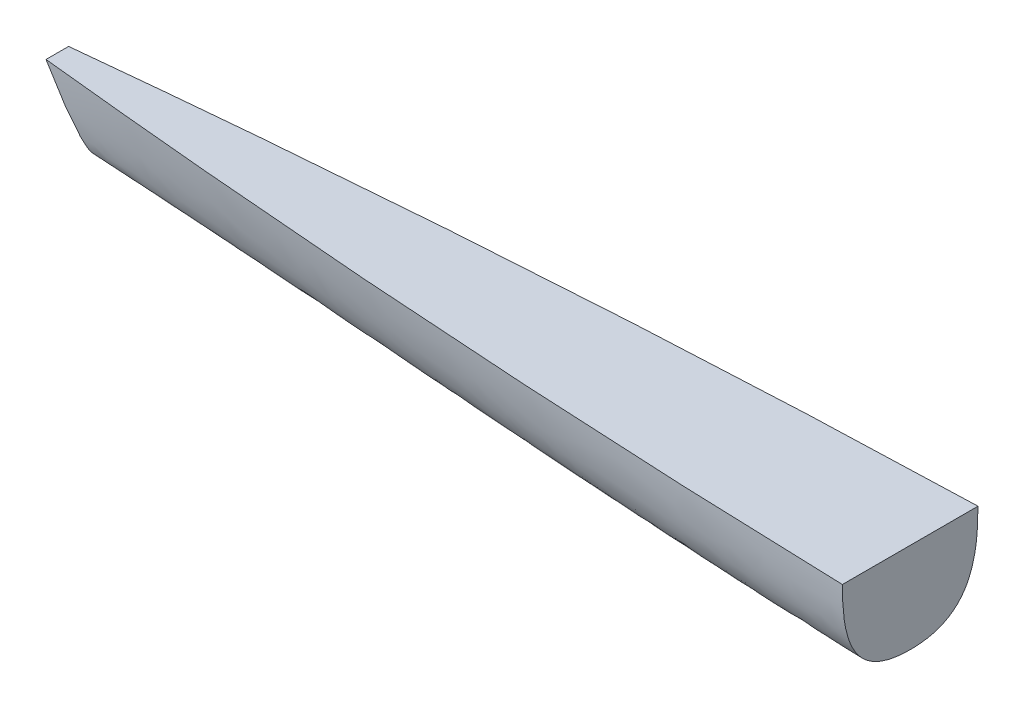
ISO-10303-21;
HEADER;
FILE_DESCRIPTION(('STEP AP214'),'2;1');
FILE_NAME('part.step','',(''),(''),'','','');
FILE_SCHEMA(('AUTOMOTIVE_DESIGN { 1 0 10303 214 1 1 1 1 }'));
ENDSEC;
DATA;
#1=APPLICATION_CONTEXT('core data for automotive mechanical design processes');
#2=APPLICATION_PROTOCOL_DEFINITION('international standard','automotive_design',2000,#1);
#3=PRODUCT_CONTEXT('',#1,'mechanical');
#4=PRODUCT('Part','Part','',(#3));
#5=PRODUCT_RELATED_PRODUCT_CATEGORY('part','',(#4));
#6=PRODUCT_DEFINITION_FORMATION('','',#4);
#7=PRODUCT_DEFINITION_CONTEXT('part definition',#1,'design');
#8=PRODUCT_DEFINITION('design','',#6,#7);
#9=PRODUCT_DEFINITION_SHAPE('','',#8);
#10=(LENGTH_UNIT() NAMED_UNIT(*) SI_UNIT(.MILLI.,.METRE.));
#11=(NAMED_UNIT(*) PLANE_ANGLE_UNIT() SI_UNIT($,.RADIAN.));
#12=(NAMED_UNIT(*) SI_UNIT($,.STERADIAN.) SOLID_ANGLE_UNIT());
#13=UNCERTAINTY_MEASURE_WITH_UNIT(LENGTH_MEASURE(1.E-05),#10,'distance_accuracy_value','');
#14=(GEOMETRIC_REPRESENTATION_CONTEXT(3) GLOBAL_UNCERTAINTY_ASSIGNED_CONTEXT((#13)) GLOBAL_UNIT_ASSIGNED_CONTEXT((#10,
#11,#12)) REPRESENTATION_CONTEXT('',''));
#15=CARTESIAN_POINT('',(0.,0.,0.));
#16=DIRECTION('',(0.,0.,1.));
#17=DIRECTION('',(1.,0.,0.));
#18=AXIS2_PLACEMENT_3D('',#15,#16,#17);
#19=CARTESIAN_POINT('',(435.202954743875,38.1,-31.75));
#20=CARTESIAN_POINT('',(289.96470358542,38.1,-40.0082514445591));
#21=CARTESIAN_POINT('',(-3.47870363388707,38.1,-44.1608103430224));
#22=CARTESIAN_POINT('',(-319.63529641458,38.1,-23.0749181112258));
#23=CARTESIAN_POINT('',(-479.197045256125,38.1,-6.35));
#24=CARTESIAN_POINT('',(456.369621410542,1.43825790645888,-31.75));
#25=CARTESIAN_POINT('',(308.744120638238,-1.38396431576335,-37.2555009630394));
#26=CARTESIAN_POINT('',(-18.3058318151969,19.9050399712793,-48.2472921755886));
#27=CARTESIAN_POINT('',(-309.322546028428,13.2807325216531,-17.4999454074839));
#28=CARTESIAN_POINT('',(-466.497045256125,16.1029547438753,-6.35));
#29=CARTESIAN_POINT('',(457.2,0.,-33.8666666666667));
#30=CARTESIAN_POINT('',(307.187249613848,-5.64444444444444,-36.6194171481864));
#31=CARTESIAN_POINT('',(-20.7324014512263,-19.7683175000991,-43.732083273171));
#32=CARTESIAN_POINT('',(-302.412750386152,-5.64444444444449,-9.80830603707527));
#33=CARTESIAN_POINT('',(-457.2,0.,-4.23333333333334));
#34=CARTESIAN_POINT('',(457.2,0.,0.));
#35=CARTESIAN_POINT('',(304.8,-8.46666666666666,0.));
#36=CARTESIAN_POINT('',(-18.3408338291158,-16.9409905000595,0.));
#37=CARTESIAN_POINT('',(-304.8,-8.46666666666668,0.));
#38=CARTESIAN_POINT('',(-457.2,0.,0.));
#39=B_SPLINE_SURFACE_WITH_KNOTS('',3,3,((#19,#20,#21,#22,#23),(#24,#25,#26,#27,#28),(#29,#30,
#31,#32,#33),(#34,#35,#36,#37,#38)),.UNSPECIFIED.,.F.,.F.,.F.,(4,4),(4,1,4),(0.,1.),(0.,
0.48497025791141,1.),.UNSPECIFIED.);
#40=CARTESIAN_POINT('',(435.202954743875,38.1,-31.75));
#41=CARTESIAN_POINT('',(289.96470358542,38.1,-40.0082514445591));
#42=CARTESIAN_POINT('',(-3.47870363388707,38.1,-44.1608103430224));
#43=CARTESIAN_POINT('',(-319.63529641458,38.1,-23.0749181112258));
#44=CARTESIAN_POINT('',(-479.197045256125,38.1,-6.35));
#45=B_SPLINE_CURVE_WITH_KNOTS('',3,(#40,#41,#42,#43,#44),.UNSPECIFIED.,.F.,.F.,(4,1,4),(0.,
0.48497025791141,1.),.UNSPECIFIED.);
#46=CARTESIAN_POINT('',(-479.197045256125,38.1,-6.35));
#47=VERTEX_POINT('',#46);
#48=CARTESIAN_POINT('',(0.,38.1,-38.1000000000008));
#49=VERTEX_POINT('',#48);
#50=EDGE_CURVE('E63',#47,#49,#45,.F.);
#51=CARTESIAN_POINT('',(1.59387635362577E-11,38.1,-38.1000000000008));
#52=CARTESIAN_POINT('',(5.72955891462524E-12,37.226321353687,-38.0999765086818));
#53=CARTESIAN_POINT('',(1.5367626246751E-12,36.3526100181256,-38.0949890198472));
#54=CARTESIAN_POINT('',(-1.53993615513407E-12,34.6035421586821,-38.0728431932275));
#55=CARTESIAN_POINT('',(-4.12857499480037E-13,33.7281859633354,-38.0556597429927));
#56=CARTESIAN_POINT('',(4.13336605165295E-13,31.9768432606056,-38.0068325038254));
#57=CARTESIAN_POINT('',(1.10793438461177E-13,31.1008572005879,-37.9751719573512));
#58=CARTESIAN_POINT('',(-1.10837327915929E-13,29.3492984705658,-37.894914525105));
#59=CARTESIAN_POINT('',(0.,28.473726101785,-37.8463109351793));
#60=CARTESIAN_POINT('',(0.,26.7045279866599,-37.7282077654566));
#61=CARTESIAN_POINT('',(0.,25.8109309698261,-37.6582700584362));
#62=CARTESIAN_POINT('',(0.,24.0263129374463,-37.4948064087426));
#63=CARTESIAN_POINT('',(0.,23.1352908650599,-37.4012921688014));
#64=CARTESIAN_POINT('',(0.,21.3569541348658,-37.1872264835341));
#65=CARTESIAN_POINT('',(0.,20.4696377316576,-37.0666896973985));
#66=CARTESIAN_POINT('',(0.,18.699871739935,-36.7946982795413));
#67=CARTESIAN_POINT('',(0.,17.8174212273931,-36.6432497412618));
#68=CARTESIAN_POINT('',(0.,16.2135485892853,-36.3347920541466));
#69=CARTESIAN_POINT('',(0.,15.4910447234123,-36.1834230682957));
#70=CARTESIAN_POINT('',(0.,14.0520148373611,-35.8540806895593));
#71=CARTESIAN_POINT('',(0.,13.3354893589012,-35.6761049128155));
#72=CARTESIAN_POINT('',(0.,11.9102124223037,-35.2907171573693));
#73=CARTESIAN_POINT('',(0.,11.2014624065328,-35.0832998134259));
#74=CARTESIAN_POINT('',(0.,9.79789409932042,-34.6372853586437));
#75=CARTESIAN_POINT('',(0.,9.1030220693067,-34.3988583382979));
#76=CARTESIAN_POINT('',(0.,7.72629025931103,-33.8870750179801));
#77=CARTESIAN_POINT('',(0.,7.04442902300543,-33.6137226539438));
#78=CARTESIAN_POINT('',(0.,5.69718240582928,-33.0292718708644));
#79=CARTESIAN_POINT('',(0.,5.03179264719587,-32.7181836137591));
#80=CARTESIAN_POINT('',(0.,3.88041053463327,-32.1360908535973));
#81=CARTESIAN_POINT('',(0.,3.39006714392858,-31.8736783345804));
#82=CARTESIAN_POINT('',(0.,2.42301021323202,-31.3248268390383));
#83=CARTESIAN_POINT('',(0.,1.94629583246889,-31.0383893489165));
#84=CARTESIAN_POINT('',(0.,1.00858406705439,-30.4408293787405));
#85=CARTESIAN_POINT('',(0.,0.547586310796632,-30.129707482908));
#86=CARTESIAN_POINT('',(0.,-0.356192177897837,-29.4826803890986));
#87=CARTESIAN_POINT('',(0.,-0.798986157879691,-29.1467937290513));
#88=CARTESIAN_POINT('',(0.,-1.66456361199939,-28.4500741226218));
#89=CARTESIAN_POINT('',(0.,-2.08734592399821,-28.0892397304352));
#90=CARTESIAN_POINT('',(0.,-2.9107739864043,-27.3431509568606));
#91=CARTESIAN_POINT('',(0.,-3.31142065989168,-26.9578975952109));
#92=CARTESIAN_POINT('',(0.,-4.09051864866947,-26.1620624969284));
#93=CARTESIAN_POINT('',(0.,-4.46885907468904,-25.7513721384393));
#94=CARTESIAN_POINT('',(0.,-5.19977462539714,-24.9076273984455));
#95=CARTESIAN_POINT('',(0.,-5.55234820877971,-24.474571681743));
#96=CARTESIAN_POINT('',(0.,-6.2305115502425,-23.5878859603573));
#97=CARTESIAN_POINT('',(0.,-6.55610337919146,-23.1342575387864));
#98=CARTESIAN_POINT('',(0.,-7.17989437807923,-22.2079913729483));
#99=CARTESIAN_POINT('',(0.,-7.4780696432119,-21.7353375468465));
#100=CARTESIAN_POINT('',(0.,-8.04648997478124,-20.7735044475421));
#101=CARTESIAN_POINT('',(0.,-8.31673330529007,-20.284324149748));
#102=CARTESIAN_POINT('',(0.,-8.82947963688997,-19.2916455426579));
#103=CARTESIAN_POINT('',(0.,-9.07198121899132,-18.7881465026019));
#104=CARTESIAN_POINT('',(0.,-9.58654081921422,-17.6426828277292));
#105=CARTESIAN_POINT('',(0.,-9.85103867159712,-16.9973157066708));
#106=CARTESIAN_POINT('',(0.,-10.3395582076258,-15.6913348651136));
#107=CARTESIAN_POINT('',(0.,-10.5635687203218,-15.0307169932738));
#108=CARTESIAN_POINT('',(0.,-10.9733586220885,-13.6976970176145));
#109=CARTESIAN_POINT('',(0.,-11.1591333226172,-13.0252934795729));
#110=CARTESIAN_POINT('',(0.,-11.4954168892135,-11.6699143813416));
#111=CARTESIAN_POINT('',(0.,-11.6458320563939,-10.9869157328167));
#112=CARTESIAN_POINT('',(0.,-11.9134271807541,-9.61461108417581));
#113=CARTESIAN_POINT('',(0.,-12.030613185359,-8.92530625533265));
#114=CARTESIAN_POINT('',(0.,-12.2344077443895,-7.5423721377786));
#115=CARTESIAN_POINT('',(0.,-12.3210213587308,-6.84874358402732));
#116=CARTESIAN_POINT('',(0.,-12.5007336459057,-5.12838979772055));
#117=CARTESIAN_POINT('',(0.,-12.5773766723995,-4.09991715907661));
#118=CARTESIAN_POINT('',(0.,-12.6520436120708,-2.55900726478948));
#119=CARTESIAN_POINT('',(0.,-12.6702221114284,-2.04740806056589));
#120=CARTESIAN_POINT('',(0.,-12.6941963429377,-1.0238789152056));
#121=CARTESIAN_POINT('',(0.,-12.6999911707813,-0.511948952645864));
#122=CARTESIAN_POINT('',(0.,-12.7,0.));
#123=B_SPLINE_CURVE_WITH_KNOTS('',3,(#51,#52,#53,#54,#55,#56,#57,#58,#59,#60,#61,#62,#63,#64,
#65,#66,#67,#68,#69,#70,#71,#72,#73,#74,#75,#76,#77,#78,#79,#80,#81,#82,#83,#84,#85,#86,#87,#88,
#89,#90,#91,#92,#93,#94,#95,#96,#97,#98,#99,#100,#101,#102,#103,#104,#105,#106,#107,#108,#109,
#110,#111,#112,#113,#114,#115,#116,#117,#118,#119,#120,#121,#122),.UNSPECIFIED.,.F.,.F.,(4,2,2,
2,2,2,2,2,2,2,2,2,2,2,2,2,2,2,2,2,2,2,2,2,2,2,2,2,2,2,2,2,2,2,2,4),(0.,2.62107113267705,
5.24755497447465,7.87708675252731,10.5076601871762,13.1963783207727,15.8837644684278,
18.5696962755038,21.2550991319554,23.4692310291679,25.683561422459,27.8982958603115,
30.1013578152933,32.3041717133129,34.5063937247179,36.1742121200127,37.8419274048954,
39.5096032306664,41.1760431321608,42.8425796905026,44.5090466999283,46.1831996036356,
47.8574525690177,49.5315769150595,51.2071473749107,52.8828219064176,54.558582110347,
56.6494751055499,58.7409441258098,60.832669453062,62.9298766688586,65.0267019654483,
67.1231800618485,70.2153152027145,71.7509682942136,73.2867335217859),.UNSPECIFIED.);
#124=CARTESIAN_POINT('',(-3.58319376848813E-10,-12.7000000000006,0.));
#125=VERTEX_POINT('',#124);
#126=EDGE_CURVE('E90',#49,#125,#123,.T.);
#127=CARTESIAN_POINT('',(457.2,0.,0.));
#128=CARTESIAN_POINT('',(304.8,-8.46666666666666,0.));
#129=CARTESIAN_POINT('',(-18.3408338291158,-16.9409905000595,0.));
#130=CARTESIAN_POINT('',(-304.8,-8.46666666666668,0.));
#131=CARTESIAN_POINT('',(-457.2,0.,0.));
#132=B_SPLINE_CURVE_WITH_KNOTS('',3,(#127,#128,#129,#130,#131),.UNSPECIFIED.,.F.,.F.,(4,1,4),
(0.,0.48497025791141,1.),.UNSPECIFIED.);
#133=CARTESIAN_POINT('',(-457.2,0.,0.));
#134=VERTEX_POINT('',#133);
#135=EDGE_CURVE('E95',#134,#125,#132,.F.);
#136=CARTESIAN_POINT('',(-479.197045256125,38.1,-6.35));
#137=CARTESIAN_POINT('',(-466.497045256125,16.1029547438753,-6.35));
#138=CARTESIAN_POINT('',(-457.2,0.,-4.23333333333334));
#139=CARTESIAN_POINT('',(-457.2,0.,0.));
#140=B_SPLINE_CURVE_WITH_KNOTS('',3,(#136,#137,#138,#139),.UNSPECIFIED.,.F.,.F.,(4,4),(0.,1.),.UNSPECIFIED.);
#141=EDGE_CURVE('E77',#47,#134,#140,.T.);
#142=ORIENTED_EDGE('',*,*,#50,.T.);
#143=ORIENTED_EDGE('',*,*,#126,.T.);
#144=ORIENTED_EDGE('',*,*,#135,.F.);
#145=ORIENTED_EDGE('',*,*,#141,.F.);
#146=EDGE_LOOP('',(#142,#143,#144,#145));
#147=FACE_BOUND('',#146,.T.);
#148=ADVANCED_FACE('F48',(#147),#39,.T.);
#149=CARTESIAN_POINT('',(0.,38.1,0.));
#150=DIRECTION('',(0.,-1.,0.));
#151=DIRECTION('',(0.,0.,-1.));
#152=AXIS2_PLACEMENT_3D('',#149,#150,#151);
#153=PLANE('',#152);
#154=DIRECTION('',(0.,0.,1.));
#155=VECTOR('',#154,1.);
#156=CARTESIAN_POINT('',(0.,38.1,0.));
#157=LINE('',#156,#155);
#158=CARTESIAN_POINT('',(1.58956186423035E-11,38.1,38.1000000000004));
#159=VERTEX_POINT('',#158);
#160=EDGE_CURVE('E70',#49,#159,#157,.T.);
#161=ORIENTED_EDGE('',*,*,#160,.F.);
#162=ORIENTED_EDGE('',*,*,#50,.F.);
#163=DIRECTION('',(0.,0.,-1.));
#164=VECTOR('',#163,1.);
#165=CARTESIAN_POINT('',(-479.197045256125,38.1,0.));
#166=LINE('',#165,#164);
#167=CARTESIAN_POINT('',(-479.197045256125,38.1,6.35));
#168=VERTEX_POINT('',#167);
#169=EDGE_CURVE('E109',#168,#47,#166,.T.);
#170=ORIENTED_EDGE('',*,*,#169,.F.);
#171=CARTESIAN_POINT('',(435.202954743875,38.1,31.75));
#172=CARTESIAN_POINT('',(289.96470358542,38.1,40.0082514445591));
#173=CARTESIAN_POINT('',(-3.47870363388707,38.1,44.1608103430224));
#174=CARTESIAN_POINT('',(-319.63529641458,38.1,23.0749181112258));
#175=CARTESIAN_POINT('',(-479.197045256125,38.1,6.35));
#176=B_SPLINE_CURVE_WITH_KNOTS('',3,(#171,#172,#173,#174,#175),.UNSPECIFIED.,.F.,.F.,(4,1,4),
(0.,0.48497025791141,1.),.UNSPECIFIED.);
#177=EDGE_CURVE('E102',#168,#159,#176,.F.);
#178=ORIENTED_EDGE('',*,*,#177,.T.);
#179=EDGE_LOOP('',(#161,#162,#170,#178));
#180=FACE_BOUND('',#179,.T.);
#181=ADVANCED_FACE('F157',(#180),#153,.F.);
#182=CARTESIAN_POINT('',(435.202954743875,38.1,31.75));
#183=CARTESIAN_POINT('',(289.96470358542,38.1,40.0082514445591));
#184=CARTESIAN_POINT('',(-3.47870363388707,38.1,44.1608103430224));
#185=CARTESIAN_POINT('',(-319.63529641458,38.1,23.0749181112258));
#186=CARTESIAN_POINT('',(-479.197045256125,38.1,6.35));
#187=CARTESIAN_POINT('',(456.369621410542,1.43825790645888,31.75));
#188=CARTESIAN_POINT('',(308.744120638238,-1.38396431576335,37.2555009630394));
#189=CARTESIAN_POINT('',(-18.3058318151969,19.9050399712793,48.2472921755886));
#190=CARTESIAN_POINT('',(-309.322546028428,13.2807325216531,17.4999454074839));
#191=CARTESIAN_POINT('',(-466.497045256125,16.1029547438753,6.35));
#192=CARTESIAN_POINT('',(457.2,0.,33.8666666666667));
#193=CARTESIAN_POINT('',(307.187249613848,-5.64444444444444,36.6194171481864));
#194=CARTESIAN_POINT('',(-20.7324014512263,-19.7683175000991,43.732083273171));
#195=CARTESIAN_POINT('',(-302.412750386152,-5.64444444444449,9.80830603707527));
#196=CARTESIAN_POINT('',(-457.2,0.,4.23333333333334));
#197=CARTESIAN_POINT('',(457.2,0.,0.));
#198=CARTESIAN_POINT('',(304.8,-8.46666666666666,0.));
#199=CARTESIAN_POINT('',(-18.3408338291158,-16.9409905000595,0.));
#200=CARTESIAN_POINT('',(-304.8,-8.46666666666668,0.));
#201=CARTESIAN_POINT('',(-457.2,0.,0.));
#202=B_SPLINE_SURFACE_WITH_KNOTS('',3,3,((#182,#183,#184,#185,#186),(#187,#188,#189,#190,#191),
(#192,#193,#194,#195,#196),(#197,#198,#199,#200,#201)),.UNSPECIFIED.,.F.,.F.,.F.,(4,4),(4,1,4),
(0.,1.),(0.,0.48497025791141,1.),.UNSPECIFIED.);
#203=CARTESIAN_POINT('',(-3.58319376848813E-10,-12.7000000000006,0.));
#204=CARTESIAN_POINT('',(-1.28875392518979E-10,-12.699977835709,0.624695521781371));
#205=CARTESIAN_POINT('',(-3.45851781758079E-11,-12.6913562006947,1.24944022781631));
#206=CARTESIAN_POINT('',(3.46953968413765E-11,-12.6553433418004,2.50037356311118));
#207=CARTESIAN_POINT('',(9.3046060768829E-12,-12.6278923891358,3.12656044895717));
#208=CARTESIAN_POINT('',(-9.32073062807363E-12,-12.5525656483212,4.37881792230176));
#209=CARTESIAN_POINT('',(-2.49947468791061E-12,-12.5046545470979,5.0048864277165));
#210=CARTESIAN_POINT('',(2.50087323373888E-12,-12.3866769354701,6.25530520865776));
#211=CARTESIAN_POINT('',(6.75127478603103E-13,-12.3165980433186,6.87965432676318));
#212=CARTESIAN_POINT('',(-6.86157201665264E-13,-12.1511533079439,8.13540135956089));
#213=CARTESIAN_POINT('',(-1.83793154864087E-13,-12.0553930500515,8.76674778990937));
#214=CARTESIAN_POINT('',(1.83652620618584E-13,-11.8372361581809,10.0243546405004));
#215=CARTESIAN_POINT('',(0.,-11.7148599472329,10.6506185805473));
#216=CARTESIAN_POINT('',(0.,-11.4415043420907,11.8963826250648));
#217=CARTESIAN_POINT('',(0.,-11.2905482655777,12.5158878110827));
#218=CARTESIAN_POINT('',(0.,-10.9580238703716,13.7464116346183));
#219=CARTESIAN_POINT('',(0.,-10.7764664708803,14.3574332153869));
#220=CARTESIAN_POINT('',(0.,-10.3212854917634,15.7510745393496));
#221=CARTESIAN_POINT('',(0.,-10.0363929638272,16.5300582209727));
#222=CARTESIAN_POINT('',(0.,-9.40785013856026,18.0642132697645));
#223=CARTESIAN_POINT('',(0.,-9.06419837725257,18.819384043083));
#224=CARTESIAN_POINT('',(0.,-8.50415756975579,19.9267544568195));
#225=CARTESIAN_POINT('',(0.,-8.31065757810144,20.2906567059836));
#226=CARTESIAN_POINT('',(0.,-7.90849046252968,21.0099656557794));
#227=CARTESIAN_POINT('',(0.,-7.69982486611319,21.3653732072303));
#228=CARTESIAN_POINT('',(0.,-7.26729684812001,22.0668532940989));
#229=CARTESIAN_POINT('',(0.,-7.0434334310304,22.4129252159198));
#230=CARTESIAN_POINT('',(0.,-6.58067854066703,23.0948292991161));
#231=CARTESIAN_POINT('',(0.,-6.34178812979622,23.4306621819009));
#232=CARTESIAN_POINT('',(0.,-5.76477587274232,24.2045703156205));
#233=CARTESIAN_POINT('',(0.,-5.42070773555419,24.6382342863996));
#234=CARTESIAN_POINT('',(0.,-4.70693847962497,25.4839513669902));
#235=CARTESIAN_POINT('',(0.,-4.33723574579964,25.8960031122654));
#236=CARTESIAN_POINT('',(0.,-3.57369133608238,26.6970340073577));
#237=CARTESIAN_POINT('',(0.,-3.17985158949554,27.0860149963745));
#238=CARTESIAN_POINT('',(0.,-2.36940603734896,27.840277216839));
#239=CARTESIAN_POINT('',(0.,-1.95277857285348,28.2055351530742));
#240=CARTESIAN_POINT('',(0.,-1.09909793349436,28.9113776636155));
#241=CARTESIAN_POINT('',(0.,-0.662043430204995,29.2519606295581));
#242=CARTESIAN_POINT('',(0.,0.230329647815322,29.9082836159118));
#243=CARTESIAN_POINT('',(0.,0.685649266685655,30.2240222130111));
#244=CARTESIAN_POINT('',(0.,1.73176262228142,30.9090520161859));
#245=CARTESIAN_POINT('',(0.,2.32724621361187,31.2711929576119));
#246=CARTESIAN_POINT('',(0.,3.53965452642487,31.9578266796012));
#247=CARTESIAN_POINT('',(0.,4.15658536214853,32.2823086079341));
#248=CARTESIAN_POINT('',(0.,5.40803124802812,32.895414144684));
#249=CARTESIAN_POINT('',(0.,6.04254815243849,33.1840339541143));
#250=CARTESIAN_POINT('',(0.,7.33100545343109,33.7298377535794));
#251=CARTESIAN_POINT('',(0.,7.98506205863698,33.9867461583697));
#252=CARTESIAN_POINT('',(0.,9.30457434698221,34.4688328223543));
#253=CARTESIAN_POINT('',(0.,9.97002789069229,34.6940169651558));
#254=CARTESIAN_POINT('',(0.,11.3099107399269,35.1152460618365));
#255=CARTESIAN_POINT('',(0.,11.9843384350024,35.3112961691085));
#256=CARTESIAN_POINT('',(0.,13.5023440886969,35.7205218364975));
#257=CARTESIAN_POINT('',(0.,14.3478335443803,35.9265960848452));
#258=CARTESIAN_POINT('',(0.,16.0469627316554,36.3026002349252));
#259=CARTESIAN_POINT('',(0.,16.9006046145695,36.4725203042925));
#260=CARTESIAN_POINT('',(0.,18.6144286010326,36.7805206337283));
#261=CARTESIAN_POINT('',(0.,19.4746162976928,36.918569504238));
#262=CARTESIAN_POINT('',(0.,21.1999738352673,37.1665965068298));
#263=CARTESIAN_POINT('',(0.,22.0651481937892,37.2765428718471));
#264=CARTESIAN_POINT('',(0.,23.7989922745746,37.4717262729365));
#265=CARTESIAN_POINT('',(0.,24.6676643417099,37.5569422401537));
#266=CARTESIAN_POINT('',(0.,26.3753711115184,37.7029921578509));
#267=CARTESIAN_POINT('',(0.,27.2143408790579,37.7645967738345));
#268=CARTESIAN_POINT('',(0.,28.892912357999,37.870176979775));
#269=CARTESIAN_POINT('',(0.,29.7325134737662,37.9141621822892));
#270=CARTESIAN_POINT('',(0.,31.4110169468245,37.986815644167));
#271=CARTESIAN_POINT('',(0.,32.2499182671268,38.0155083409157));
#272=CARTESIAN_POINT('',(0.,33.9256908895729,38.0597575423284));
#273=CARTESIAN_POINT('',(0.,34.7625612608022,38.0753507872726));
#274=CARTESIAN_POINT('',(0.,36.4329637755437,38.0954394955878));
#275=CARTESIAN_POINT('',(0.,37.2664953507264,38.0999807734656));
#276=CARTESIAN_POINT('',(0.,38.1,38.1));
#277=B_SPLINE_CURVE_WITH_KNOTS('',3,(#203,#204,#205,#206,#207,#208,#209,#210,#211,#212,#213,
#214,#215,#216,#217,#218,#219,#220,#221,#222,#223,#224,#225,#226,#227,#228,#229,#230,#231,#232,
#233,#234,#235,#236,#237,#238,#239,#240,#241,#242,#243,#244,#245,#246,#247,#248,#249,#250,#251,
#252,#253,#254,#255,#256,#257,#258,#259,#260,#261,#262,#263,#264,#265,#266,#267,#268,#269,#270,
#271,#272,#273,#274,#275,#276),.UNSPECIFIED.,.F.,.F.,(4,2,2,2,2,2,2,2,2,2,2,2,2,2,2,2,2,2,2,2,2,
2,2,2,2,2,2,2,2,2,2,2,2,2,2,2,4),(0.,1.87410092792285,3.75417438264221,5.63750593774888,
7.5218912844792,9.4370622963995,11.3507689060499,13.262920841213,15.1743919188251,
17.660513098035,20.146696227587,21.3828391409371,22.6188577203307,23.8549573417329,
25.090969669354,26.7506447641596,28.4104245204518,30.0700717808276,31.7313248577737,
33.3926861212466,35.0541424934342,37.1434942465107,39.2334466027207,41.3236201657288,
43.4308409307273,45.5376703729415,47.6441267025232,50.2539082722774,52.8643986845497,
55.4774492723972,58.0934407175173,60.7116543357028,63.2351307524227,65.7572285643823,
68.2752838939576,70.7862529808069,73.2867953034928),.UNSPECIFIED.);
#278=EDGE_CURVE('E12',#125,#159,#277,.T.);
#279=CARTESIAN_POINT('',(-479.197045256125,38.1,6.35));
#280=CARTESIAN_POINT('',(-466.497045256125,16.1029547438753,6.35));
#281=CARTESIAN_POINT('',(-457.2,0.,4.23333333333334));
#282=CARTESIAN_POINT('',(-457.2,0.,0.));
#283=B_SPLINE_CURVE_WITH_KNOTS('',3,(#279,#280,#281,#282),.UNSPECIFIED.,.F.,.F.,(4,4),(0.,1.),.UNSPECIFIED.);
#284=EDGE_CURVE('E97',#168,#134,#283,.T.);
#285=ORIENTED_EDGE('',*,*,#135,.T.);
#286=ORIENTED_EDGE('',*,*,#278,.T.);
#287=ORIENTED_EDGE('',*,*,#177,.F.);
#288=ORIENTED_EDGE('',*,*,#284,.T.);
#289=EDGE_LOOP('',(#285,#286,#287,#288));
#290=FACE_BOUND('',#289,.T.);
#291=ADVANCED_FACE('F99',(#290),#202,.F.);
#292=CARTESIAN_POINT('',(-342.899999999998,-197.973407305124,0.));
#293=DIRECTION('',(-0.866025403784436,-0.500000000000004,0.));
#294=DIRECTION('',(0.500000000000004,-0.866025403784436,0.));
#295=AXIS2_PLACEMENT_3D('',#292,#293,#294);
#296=PLANE('',#295);
#297=ORIENTED_EDGE('',*,*,#169,.T.);
#298=ORIENTED_EDGE('',*,*,#141,.T.);
#299=ORIENTED_EDGE('',*,*,#284,.F.);
#300=EDGE_LOOP('',(#297,#298,#299));
#301=FACE_BOUND('',#300,.T.);
#302=ADVANCED_FACE('F155',(#301),#296,.T.);
#303=CARTESIAN_POINT('',(0.,0.,0.));
#304=DIRECTION('',(1.,0.,0.));
#305=DIRECTION('',(0.,0.,-1.));
#306=AXIS2_PLACEMENT_3D('',#303,#304,#305);
#307=PLANE('',#306);
#308=ORIENTED_EDGE('',*,*,#160,.T.);
#309=ORIENTED_EDGE('',*,*,#278,.F.);
#310=ORIENTED_EDGE('',*,*,#126,.F.);
#311=EDGE_LOOP('',(#308,#309,#310));
#312=FACE_BOUND('',#311,.T.);
#313=ADVANCED_FACE('F89',(#312),#307,.T.);
#314=CLOSED_SHELL('',(#148,#181,#291,#302,#313));
#315=MANIFOLD_SOLID_BREP('B2',#314);
#316=ADVANCED_BREP_SHAPE_REPRESENTATION('',(#18,#315),#14);
#317=SHAPE_DEFINITION_REPRESENTATION(#9,#316);
ENDSEC;
END-ISO-10303-21;
